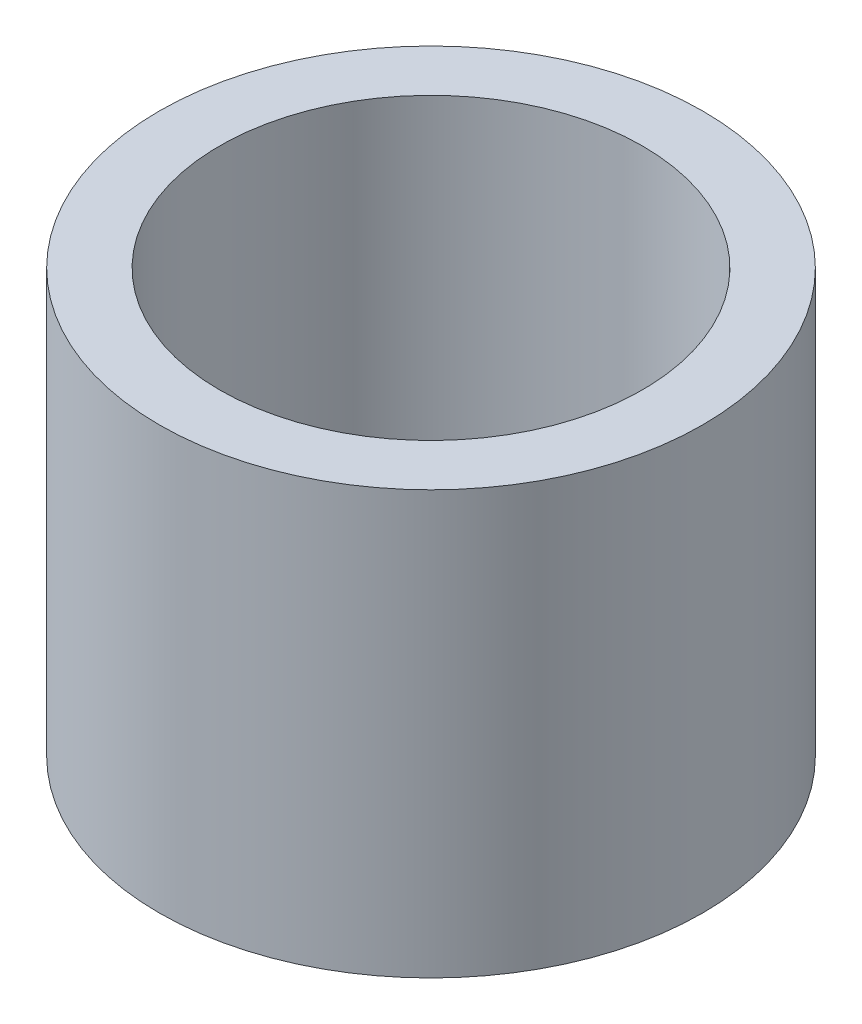
ISO-10303-21;
HEADER;
FILE_DESCRIPTION(('STEP AP214'),'2;1');
FILE_NAME('part.step','',(''),(''),'','','');
FILE_SCHEMA(('AUTOMOTIVE_DESIGN { 1 0 10303 214 1 1 1 1 }'));
ENDSEC;
DATA;
#1=APPLICATION_CONTEXT('core data for automotive mechanical design processes');
#2=APPLICATION_PROTOCOL_DEFINITION('international standard','automotive_design',2000,#1);
#3=PRODUCT_CONTEXT('',#1,'mechanical');
#4=PRODUCT('Part','Part','',(#3));
#5=PRODUCT_RELATED_PRODUCT_CATEGORY('part','',(#4));
#6=PRODUCT_DEFINITION_FORMATION('','',#4);
#7=PRODUCT_DEFINITION_CONTEXT('part definition',#1,'design');
#8=PRODUCT_DEFINITION('design','',#6,#7);
#9=PRODUCT_DEFINITION_SHAPE('','',#8);
#10=(LENGTH_UNIT() NAMED_UNIT(*) SI_UNIT(.MILLI.,.METRE.));
#11=(NAMED_UNIT(*) PLANE_ANGLE_UNIT() SI_UNIT($,.RADIAN.));
#12=(NAMED_UNIT(*) SI_UNIT($,.STERADIAN.) SOLID_ANGLE_UNIT());
#13=UNCERTAINTY_MEASURE_WITH_UNIT(LENGTH_MEASURE(1.E-05),#10,'distance_accuracy_value','');
#14=(GEOMETRIC_REPRESENTATION_CONTEXT(3) GLOBAL_UNCERTAINTY_ASSIGNED_CONTEXT((#13)) GLOBAL_UNIT_ASSIGNED_CONTEXT((#10,
#11,#12)) REPRESENTATION_CONTEXT('',''));
#15=CARTESIAN_POINT('',(0.,0.,0.));
#16=DIRECTION('',(0.,0.,1.));
#17=DIRECTION('',(1.,0.,0.));
#18=AXIS2_PLACEMENT_3D('',#15,#16,#17);
#19=CARTESIAN_POINT('',(0.,7.,0.));
#20=DIRECTION('',(0.,1.,0.));
#21=DIRECTION('',(0.,0.,1.));
#22=AXIS2_PLACEMENT_3D('',#19,#20,#21);
#23=PLANE('',#22);
#24=CARTESIAN_POINT('',(0.,7.,0.));
#25=DIRECTION('',(0.,1.,0.));
#26=DIRECTION('',(0.,0.,1.));
#27=AXIS2_PLACEMENT_3D('',#24,#25,#26);
#28=CIRCLE('',#27,4.5);
#29=CARTESIAN_POINT('',(0.,7.,4.5));
#30=VERTEX_POINT('',#29);
#31=EDGE_CURVE('E10',#30,#30,#28,.T.);
#32=ORIENTED_EDGE('',*,*,#31,.T.);
#33=EDGE_LOOP('',(#32));
#34=FACE_BOUND('',#33,.T.);
#35=CARTESIAN_POINT('',(0.,7.,0.));
#36=DIRECTION('',(0.,1.,0.));
#37=DIRECTION('',(0.,0.,1.));
#38=AXIS2_PLACEMENT_3D('',#35,#36,#37);
#39=CIRCLE('',#38,3.5);
#40=CARTESIAN_POINT('',(0.,7.,3.5));
#41=VERTEX_POINT('',#40);
#42=EDGE_CURVE('E50',#41,#41,#39,.T.);
#43=ORIENTED_EDGE('',*,*,#42,.F.);
#44=EDGE_LOOP('',(#43));
#45=FACE_BOUND('',#44,.T.);
#46=ADVANCED_FACE('F37',(#34,#45),#23,.T.);
#47=CARTESIAN_POINT('',(0.,0.,0.));
#48=DIRECTION('',(0.,1.,0.));
#49=DIRECTION('',(0.,0.,1.));
#50=AXIS2_PLACEMENT_3D('',#47,#48,#49);
#51=PLANE('',#50);
#52=CARTESIAN_POINT('',(0.,0.,0.));
#53=DIRECTION('',(0.,1.,0.));
#54=DIRECTION('',(0.,0.,1.));
#55=AXIS2_PLACEMENT_3D('',#52,#53,#54);
#56=CIRCLE('',#55,4.5);
#57=CARTESIAN_POINT('',(0.,0.,4.5));
#58=VERTEX_POINT('',#57);
#59=EDGE_CURVE('E41',#58,#58,#56,.T.);
#60=ORIENTED_EDGE('',*,*,#59,.F.);
#61=EDGE_LOOP('',(#60));
#62=FACE_BOUND('',#61,.T.);
#63=CARTESIAN_POINT('',(0.,0.,0.));
#64=DIRECTION('',(0.,1.,0.));
#65=DIRECTION('',(0.,0.,1.));
#66=AXIS2_PLACEMENT_3D('',#63,#64,#65);
#67=CIRCLE('',#66,3.5);
#68=CARTESIAN_POINT('',(0.,0.,3.5));
#69=VERTEX_POINT('',#68);
#70=EDGE_CURVE('E52',#69,#69,#67,.T.);
#71=ORIENTED_EDGE('',*,*,#70,.T.);
#72=EDGE_LOOP('',(#71));
#73=FACE_BOUND('',#72,.T.);
#74=ADVANCED_FACE('F64',(#62,#73),#51,.F.);
#75=CARTESIAN_POINT('',(0.,7.,0.));
#76=DIRECTION('',(0.,-1.,0.));
#77=DIRECTION('',(0.,0.,-1.));
#78=AXIS2_PLACEMENT_3D('',#75,#76,#77);
#79=CYLINDRICAL_SURFACE('',#78,4.5);
#80=ORIENTED_EDGE('',*,*,#31,.F.);
#81=EDGE_LOOP('',(#80));
#82=FACE_BOUND('',#81,.T.);
#83=ORIENTED_EDGE('',*,*,#59,.T.);
#84=EDGE_LOOP('',(#83));
#85=FACE_BOUND('',#84,.T.);
#86=ADVANCED_FACE('F39',(#82,#85),#79,.T.);
#87=CARTESIAN_POINT('',(0.,7.,0.));
#88=DIRECTION('',(0.,-1.,0.));
#89=DIRECTION('',(0.,0.,-1.));
#90=AXIS2_PLACEMENT_3D('',#87,#88,#89);
#91=CYLINDRICAL_SURFACE('',#90,3.5);
#92=ORIENTED_EDGE('',*,*,#42,.T.);
#93=EDGE_LOOP('',(#92));
#94=FACE_BOUND('',#93,.T.);
#95=ORIENTED_EDGE('',*,*,#70,.F.);
#96=EDGE_LOOP('',(#95));
#97=FACE_BOUND('',#96,.T.);
#98=ADVANCED_FACE('F60',(#94,#97),#91,.F.);
#99=CLOSED_SHELL('',(#46,#74,#86,#98));
#100=MANIFOLD_SOLID_BREP('B2',#99);
#101=ADVANCED_BREP_SHAPE_REPRESENTATION('',(#18,#100),#14);
#102=SHAPE_DEFINITION_REPRESENTATION(#9,#101);
ENDSEC;
END-ISO-10303-21;
